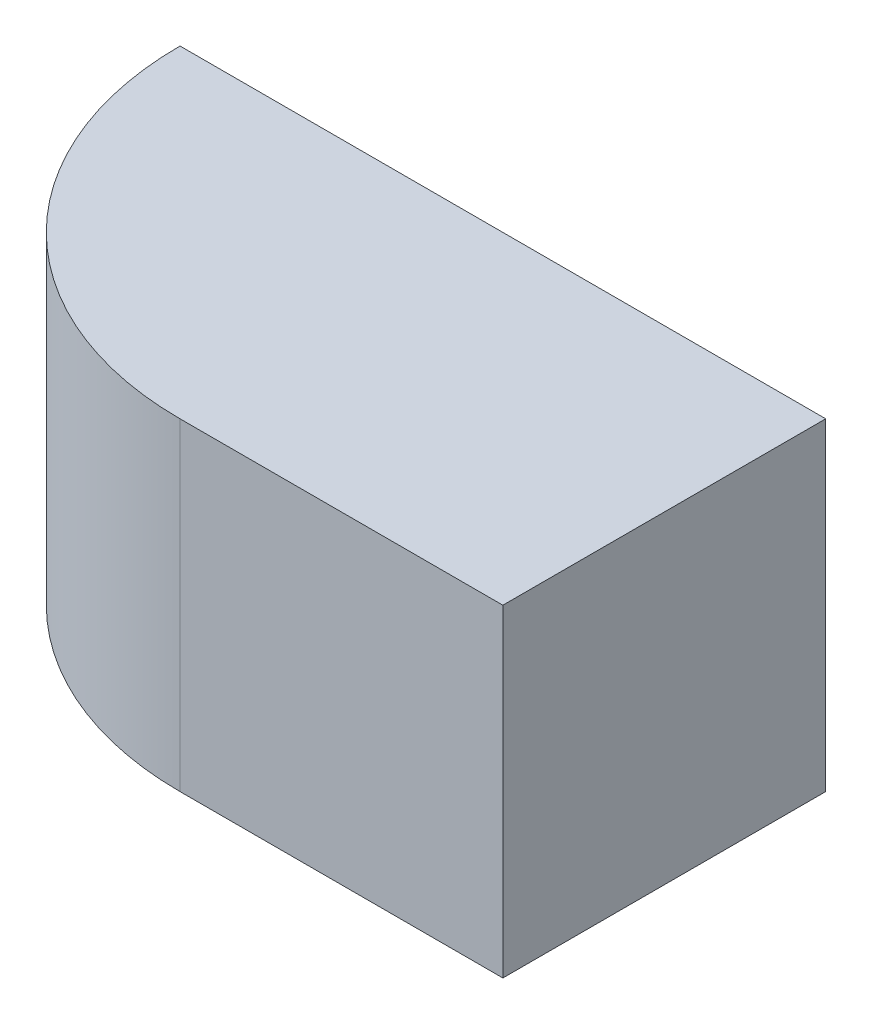
ISO-10303-21;
HEADER;
FILE_DESCRIPTION(('STEP AP214'),'2;1');
FILE_NAME('part.step','',(''),(''),'','','');
FILE_SCHEMA(('AUTOMOTIVE_DESIGN { 1 0 10303 214 1 1 1 1 }'));
ENDSEC;
DATA;
#1=APPLICATION_CONTEXT('core data for automotive mechanical design processes');
#2=APPLICATION_PROTOCOL_DEFINITION('international standard','automotive_design',2000,#1);
#3=PRODUCT_CONTEXT('',#1,'mechanical');
#4=PRODUCT('Part','Part','',(#3));
#5=PRODUCT_RELATED_PRODUCT_CATEGORY('part','',(#4));
#6=PRODUCT_DEFINITION_FORMATION('','',#4);
#7=PRODUCT_DEFINITION_CONTEXT('part definition',#1,'design');
#8=PRODUCT_DEFINITION('design','',#6,#7);
#9=PRODUCT_DEFINITION_SHAPE('','',#8);
#10=(LENGTH_UNIT() NAMED_UNIT(*) SI_UNIT(.MILLI.,.METRE.));
#11=(NAMED_UNIT(*) PLANE_ANGLE_UNIT() SI_UNIT($,.RADIAN.));
#12=(NAMED_UNIT(*) SI_UNIT($,.STERADIAN.) SOLID_ANGLE_UNIT());
#13=UNCERTAINTY_MEASURE_WITH_UNIT(LENGTH_MEASURE(1.E-05),#10,'distance_accuracy_value','');
#14=(GEOMETRIC_REPRESENTATION_CONTEXT(3) GLOBAL_UNCERTAINTY_ASSIGNED_CONTEXT((#13)) GLOBAL_UNIT_ASSIGNED_CONTEXT((#10,
#11,#12)) REPRESENTATION_CONTEXT('',''));
#15=CARTESIAN_POINT('',(0.,0.,0.));
#16=DIRECTION('',(0.,0.,1.));
#17=DIRECTION('',(1.,0.,0.));
#18=AXIS2_PLACEMENT_3D('',#15,#16,#17);
#19=CARTESIAN_POINT('',(-2.00000002980232,-4.75000013038516,2.));
#20=DIRECTION('',(0.,0.,1.));
#21=DIRECTION('',(1.,0.,0.));
#22=AXIS2_PLACEMENT_3D('',#19,#20,#21);
#23=PLANE('',#22);
#24=DIRECTION('',(-1.,0.,0.));
#25=VECTOR('',#24,1.);
#26=CARTESIAN_POINT('',(-1.50000002235174,-5.00000013411045,2.));
#27=LINE('',#26,#25);
#28=CARTESIAN_POINT('',(-1.50000002235174,-5.00000013411045,2.));
#29=VERTEX_POINT('',#28);
#30=CARTESIAN_POINT('',(-2.5000000372529,-5.00000013411045,2.));
#31=VERTEX_POINT('',#30);
#32=EDGE_CURVE('E21',#29,#31,#27,.T.);
#33=ORIENTED_EDGE('',*,*,#32,.T.);
#34=DIRECTION('',(0.,1.,0.));
#35=VECTOR('',#34,1.);
#36=CARTESIAN_POINT('',(-2.5000000372529,-5.00000013411045,2.));
#37=LINE('',#36,#35);
#38=CARTESIAN_POINT('',(-2.5000000372529,-4.50000012665987,2.));
#39=VERTEX_POINT('',#38);
#40=EDGE_CURVE('E67',#31,#39,#37,.T.);
#41=ORIENTED_EDGE('',*,*,#40,.T.);
#42=DIRECTION('',(1.,0.,0.));
#43=VECTOR('',#42,1.);
#44=CARTESIAN_POINT('',(-2.5000000372529,-4.50000012665987,2.));
#45=LINE('',#44,#43);
#46=CARTESIAN_POINT('',(-1.50000002235174,-4.50000012665987,2.));
#47=VERTEX_POINT('',#46);
#48=EDGE_CURVE('E94',#39,#47,#45,.T.);
#49=ORIENTED_EDGE('',*,*,#48,.T.);
#50=DIRECTION('',(0.,-1.,0.));
#51=VECTOR('',#50,1.);
#52=CARTESIAN_POINT('',(-1.50000002235174,-4.50000012665987,2.));
#53=LINE('',#52,#51);
#54=EDGE_CURVE('E28',#47,#29,#53,.T.);
#55=ORIENTED_EDGE('',*,*,#54,.T.);
#56=EDGE_LOOP('',(#33,#41,#49,#55));
#57=FACE_BOUND('',#56,.T.);
#58=ADVANCED_FACE('F17',(#57),#23,.F.);
#59=CARTESIAN_POINT('',(-2.00000002980232,-4.75000013038516,2.5));
#60=DIRECTION('',(0.,0.,1.));
#61=DIRECTION('',(1.,0.,0.));
#62=AXIS2_PLACEMENT_3D('',#59,#60,#61);
#63=PLANE('',#62);
#64=DIRECTION('',(0.,1.,0.));
#65=VECTOR('',#64,1.);
#66=CARTESIAN_POINT('',(-2.0000000372529,-4.62500012852252,2.5));
#67=LINE('',#66,#65);
#68=CARTESIAN_POINT('',(-2.0000000372529,-5.00000013411045,2.5));
#69=VERTEX_POINT('',#68);
#70=CARTESIAN_POINT('',(-2.0000000372529,-4.50000012665987,2.5));
#71=VERTEX_POINT('',#70);
#72=EDGE_CURVE('E82',#69,#71,#67,.T.);
#73=ORIENTED_EDGE('',*,*,#72,.F.);
#74=DIRECTION('',(1.,0.,0.));
#75=VECTOR('',#74,1.);
#76=CARTESIAN_POINT('',(-1.50000002235174,-5.00000013411045,2.5));
#77=LINE('',#76,#75);
#78=CARTESIAN_POINT('',(-1.50000002235174,-5.00000013411045,2.5));
#79=VERTEX_POINT('',#78);
#80=EDGE_CURVE('E57',#69,#79,#77,.T.);
#81=ORIENTED_EDGE('',*,*,#80,.T.);
#82=DIRECTION('',(0.,1.,0.));
#83=VECTOR('',#82,1.);
#84=CARTESIAN_POINT('',(-1.50000002235174,-4.50000012665987,2.5));
#85=LINE('',#84,#83);
#86=CARTESIAN_POINT('',(-1.50000002235174,-4.50000012665987,2.5));
#87=VERTEX_POINT('',#86);
#88=EDGE_CURVE('E11',#79,#87,#85,.T.);
#89=ORIENTED_EDGE('',*,*,#88,.T.);
#90=DIRECTION('',(-1.,0.,0.));
#91=VECTOR('',#90,1.);
#92=CARTESIAN_POINT('',(-2.5000000372529,-4.50000012665987,2.5));
#93=LINE('',#92,#91);
#94=EDGE_CURVE('E90',#87,#71,#93,.T.);
#95=ORIENTED_EDGE('',*,*,#94,.T.);
#96=EDGE_LOOP('',(#73,#81,#89,#95));
#97=FACE_BOUND('',#96,.T.);
#98=ADVANCED_FACE('F113',(#97),#63,.T.);
#99=CARTESIAN_POINT('',(-1.50000002235174,-5.00000013411045,2.));
#100=DIRECTION('',(1.,0.,0.));
#101=DIRECTION('',(0.,1.,0.));
#102=AXIS2_PLACEMENT_3D('',#99,#100,#101);
#103=PLANE('',#102);
#104=ORIENTED_EDGE('',*,*,#54,.F.);
#105=DIRECTION('',(0.,0.,1.));
#106=VECTOR('',#105,1.);
#107=CARTESIAN_POINT('',(-1.50000002235174,-4.50000012665987,2.));
#108=LINE('',#107,#106);
#109=EDGE_CURVE('E98',#47,#87,#108,.T.);
#110=ORIENTED_EDGE('',*,*,#109,.T.);
#111=ORIENTED_EDGE('',*,*,#88,.F.);
#112=DIRECTION('',(0.,0.,1.));
#113=VECTOR('',#112,1.);
#114=CARTESIAN_POINT('',(-1.50000002235174,-5.00000013411045,2.));
#115=LINE('',#114,#113);
#116=EDGE_CURVE('E71',#29,#79,#115,.T.);
#117=ORIENTED_EDGE('',*,*,#116,.F.);
#118=EDGE_LOOP('',(#104,#110,#111,#117));
#119=FACE_BOUND('',#118,.T.);
#120=ADVANCED_FACE('F108',(#119),#103,.T.);
#121=CARTESIAN_POINT('',(-1.50000002235174,-4.50000012665987,2.));
#122=DIRECTION('',(0.,1.,0.));
#123=DIRECTION('',(1.,0.,0.));
#124=AXIS2_PLACEMENT_3D('',#121,#122,#123);
#125=PLANE('',#124);
#126=CARTESIAN_POINT('',(-2.0000000372529,-4.50000012665987,2.));
#127=DIRECTION('',(0.,-1.,0.));
#128=DIRECTION('',(-0.707106781186548,0.,0.707106781186548));
#129=AXIS2_PLACEMENT_3D('',#126,#127,#128);
#130=CIRCLE('',#129,0.5);
#131=EDGE_CURVE('E77',#71,#39,#130,.T.);
#132=ORIENTED_EDGE('',*,*,#131,.F.);
#133=ORIENTED_EDGE('',*,*,#94,.F.);
#134=ORIENTED_EDGE('',*,*,#109,.F.);
#135=ORIENTED_EDGE('',*,*,#48,.F.);
#136=EDGE_LOOP('',(#132,#133,#134,#135));
#137=FACE_BOUND('',#136,.T.);
#138=ADVANCED_FACE('F111',(#137),#125,.T.);
#139=CARTESIAN_POINT('',(-2.5000000372529,-5.00000013411045,2.));
#140=DIRECTION('',(0.,-1.,0.));
#141=DIRECTION('',(0.,0.,-1.));
#142=AXIS2_PLACEMENT_3D('',#139,#140,#141);
#143=PLANE('',#142);
#144=CARTESIAN_POINT('',(-2.0000000372529,-5.00000013411045,2.));
#145=DIRECTION('',(0.,1.,0.));
#146=DIRECTION('',(-0.707106781186548,0.,0.707106781186548));
#147=AXIS2_PLACEMENT_3D('',#144,#145,#146);
#148=CIRCLE('',#147,0.5);
#149=EDGE_CURVE('E75',#31,#69,#148,.T.);
#150=ORIENTED_EDGE('',*,*,#149,.F.);
#151=ORIENTED_EDGE('',*,*,#32,.F.);
#152=ORIENTED_EDGE('',*,*,#116,.T.);
#153=ORIENTED_EDGE('',*,*,#80,.F.);
#154=EDGE_LOOP('',(#150,#151,#152,#153));
#155=FACE_BOUND('',#154,.T.);
#156=ADVANCED_FACE('F80',(#155),#143,.T.);
#157=CARTESIAN_POINT('',(-2.0000000372529,-4.62500012852252,2.));
#158=DIRECTION('',(0.,-1.,0.));
#159=DIRECTION('',(-0.707106781186548,0.,0.707106781186548));
#160=AXIS2_PLACEMENT_3D('',#157,#158,#159);
#161=CYLINDRICAL_SURFACE('',#160,0.5);
#162=ORIENTED_EDGE('',*,*,#149,.T.);
#163=ORIENTED_EDGE('',*,*,#72,.T.);
#164=ORIENTED_EDGE('',*,*,#131,.T.);
#165=ORIENTED_EDGE('',*,*,#40,.F.);
#166=EDGE_LOOP('',(#162,#163,#164,#165));
#167=FACE_BOUND('',#166,.T.);
#168=ADVANCED_FACE('F19',(#167),#161,.T.);
#169=CLOSED_SHELL('',(#58,#98,#120,#138,#156,#168));
#170=MANIFOLD_SOLID_BREP('B1',#169);
#171=ADVANCED_BREP_SHAPE_REPRESENTATION('',(#18,#170),#14);
#172=SHAPE_DEFINITION_REPRESENTATION(#9,#171);
ENDSEC;
END-ISO-10303-21;
